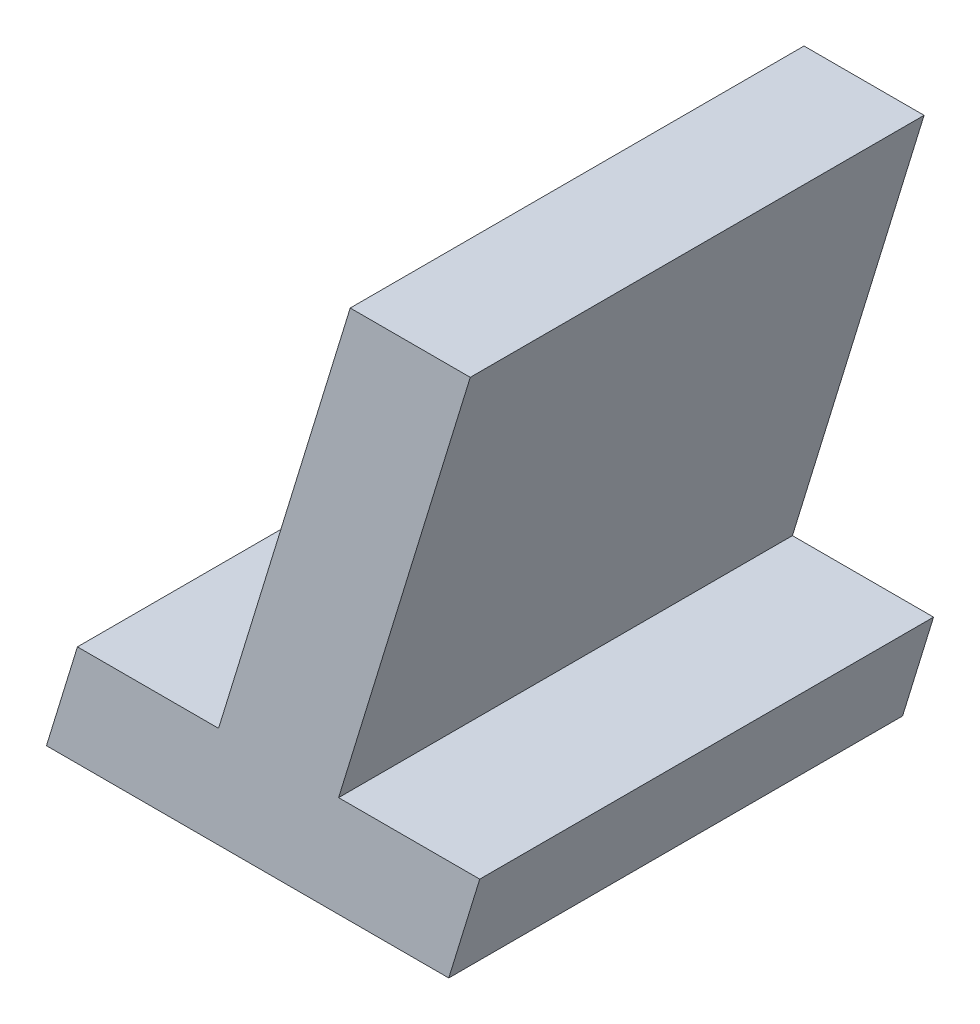
ISO-10303-21;
HEADER;
FILE_DESCRIPTION(('STEP AP214'),'2;1');
FILE_NAME('part.step','',(''),(''),'','','');
FILE_SCHEMA(('AUTOMOTIVE_DESIGN { 1 0 10303 214 1 1 1 1 }'));
ENDSEC;
DATA;
#1=APPLICATION_CONTEXT('core data for automotive mechanical design processes');
#2=APPLICATION_PROTOCOL_DEFINITION('international standard','automotive_design',2000,#1);
#3=PRODUCT_CONTEXT('',#1,'mechanical');
#4=PRODUCT('Part','Part','',(#3));
#5=PRODUCT_RELATED_PRODUCT_CATEGORY('part','',(#4));
#6=PRODUCT_DEFINITION_FORMATION('','',#4);
#7=PRODUCT_DEFINITION_CONTEXT('part definition',#1,'design');
#8=PRODUCT_DEFINITION('design','',#6,#7);
#9=PRODUCT_DEFINITION_SHAPE('','',#8);
#10=(LENGTH_UNIT() NAMED_UNIT(*) SI_UNIT(.MILLI.,.METRE.));
#11=(NAMED_UNIT(*) PLANE_ANGLE_UNIT() SI_UNIT($,.RADIAN.));
#12=(NAMED_UNIT(*) SI_UNIT($,.STERADIAN.) SOLID_ANGLE_UNIT());
#13=UNCERTAINTY_MEASURE_WITH_UNIT(LENGTH_MEASURE(1.E-05),#10,'distance_accuracy_value','');
#14=(GEOMETRIC_REPRESENTATION_CONTEXT(3) GLOBAL_UNCERTAINTY_ASSIGNED_CONTEXT((#13)) GLOBAL_UNIT_ASSIGNED_CONTEXT((#10,
#11,#12)) REPRESENTATION_CONTEXT('',''));
#15=CARTESIAN_POINT('',(0.,0.,0.));
#16=DIRECTION('',(0.,0.,1.));
#17=DIRECTION('',(1.,0.,0.));
#18=AXIS2_PLACEMENT_3D('',#15,#16,#17);
#19=CARTESIAN_POINT('',(5.134104397564,3.535074669142,0.));
#20=DIRECTION('',(-0.956150738053356,0.292875000845109,0.));
#21=DIRECTION('',(-0.292875000845109,-0.956150738053356,0.));
#22=AXIS2_PLACEMENT_3D('',#19,#20,#21);
#23=PLANE('',#22);
#24=DIRECTION('',(-0.292875000836855,-0.956150738055884,0.));
#25=VECTOR('',#24,1.);
#26=CARTESIAN_POINT('',(5.134104397564,3.535074669142,0.1));
#27=LINE('',#26,#25);
#28=CARTESIAN_POINT('',(5.134104397564,3.535074669142,0.1));
#29=VERTEX_POINT('',#28);
#30=CARTESIAN_POINT('',(5.10509143007759,3.44035586352313,0.1));
#31=VERTEX_POINT('',#30);
#32=EDGE_CURVE('E122',#29,#31,#27,.T.);
#33=ORIENTED_EDGE('',*,*,#32,.F.);
#34=DIRECTION('',(0.,0.,1.));
#35=VECTOR('',#34,1.);
#36=CARTESIAN_POINT('',(5.134104397564,3.535074669142,0.));
#37=LINE('',#36,#35);
#38=CARTESIAN_POINT('',(5.134104397564,3.535074669142,0.));
#39=VERTEX_POINT('',#38);
#40=EDGE_CURVE('E87',#39,#29,#37,.T.);
#41=ORIENTED_EDGE('',*,*,#40,.F.);
#42=DIRECTION('',(-0.292875000836855,-0.956150738055884,0.));
#43=VECTOR('',#42,1.);
#44=CARTESIAN_POINT('',(5.134104397564,3.535074669142,0.));
#45=LINE('',#44,#43);
#46=CARTESIAN_POINT('',(5.10509143007759,3.44035586352313,0.));
#47=VERTEX_POINT('',#46);
#48=EDGE_CURVE('E84',#39,#47,#45,.T.);
#49=ORIENTED_EDGE('',*,*,#48,.T.);
#50=DIRECTION('',(0.,0.,1.));
#51=VECTOR('',#50,1.);
#52=CARTESIAN_POINT('',(5.105091430078,3.440355863523,0.));
#53=LINE('',#52,#51);
#54=EDGE_CURVE('E20',#31,#47,#53,.F.);
#55=ORIENTED_EDGE('',*,*,#54,.F.);
#56=EDGE_LOOP('',(#33,#41,#49,#55));
#57=FACE_BOUND('',#56,.T.);
#58=ADVANCED_FACE('F17',(#57),#23,.T.);
#59=CARTESIAN_POINT('',(5.105091430078,3.440355863523,0.));
#60=DIRECTION('',(0.,1.,0.));
#61=DIRECTION('',(0.,0.,1.));
#62=AXIS2_PLACEMENT_3D('',#59,#60,#61);
#63=PLANE('',#62);
#64=DIRECTION('',(1.,0.,0.));
#65=VECTOR('',#64,1.);
#66=CARTESIAN_POINT('',(5.125135669025,3.440355863523,0.1));
#67=LINE('',#66,#65);
#68=CARTESIAN_POINT('',(5.073992562968,3.440355863523,0.1));
#69=VERTEX_POINT('',#68);
#70=EDGE_CURVE('E94',#31,#69,#67,.F.);
#71=ORIENTED_EDGE('',*,*,#70,.F.);
#72=ORIENTED_EDGE('',*,*,#54,.T.);
#73=DIRECTION('',(1.,0.,0.));
#74=VECTOR('',#73,1.);
#75=CARTESIAN_POINT('',(5.125135669025,3.440355863523,0.));
#76=LINE('',#75,#74);
#77=CARTESIAN_POINT('',(5.073992562968,3.440355863523,0.));
#78=VERTEX_POINT('',#77);
#79=EDGE_CURVE('E79',#47,#78,#76,.F.);
#80=ORIENTED_EDGE('',*,*,#79,.T.);
#81=DIRECTION('',(0.,0.,1.));
#82=VECTOR('',#81,1.);
#83=CARTESIAN_POINT('',(5.073992562968,3.440355863523,0.));
#84=LINE('',#83,#82);
#85=EDGE_CURVE('E96',#69,#78,#84,.F.);
#86=ORIENTED_EDGE('',*,*,#85,.F.);
#87=EDGE_LOOP('',(#71,#72,#80,#86));
#88=FACE_BOUND('',#87,.T.);
#89=ADVANCED_FACE('F92',(#88),#63,.T.);
#90=CARTESIAN_POINT('',(5.073992562968,3.440355863523,0.));
#91=DIRECTION('',(-0.956130206843123,0.292942020820038,0.));
#92=DIRECTION('',(-0.292942020820038,-0.956130206843123,0.));
#93=AXIS2_PLACEMENT_3D('',#90,#91,#92);
#94=PLANE('',#93);
#95=DIRECTION('',(-0.292942020813839,-0.956130206845022,0.));
#96=VECTOR('',#95,1.);
#97=CARTESIAN_POINT('',(5.073992562968,3.440355863523,0.1));
#98=LINE('',#97,#96);
#99=CARTESIAN_POINT('',(5.06716598238293,3.41807466300202,0.1));
#100=VERTEX_POINT('',#99);
#101=EDGE_CURVE('E115',#69,#100,#98,.T.);
#102=ORIENTED_EDGE('',*,*,#101,.F.);
#103=ORIENTED_EDGE('',*,*,#85,.T.);
#104=DIRECTION('',(-0.292942020813839,-0.956130206845022,0.));
#105=VECTOR('',#104,1.);
#106=CARTESIAN_POINT('',(5.073992562968,3.440355863523,0.));
#107=LINE('',#106,#105);
#108=CARTESIAN_POINT('',(5.06716598238293,3.41807466300202,0.));
#109=VERTEX_POINT('',#108);
#110=EDGE_CURVE('E101',#78,#109,#107,.T.);
#111=ORIENTED_EDGE('',*,*,#110,.T.);
#112=DIRECTION('',(0.,0.,-1.));
#113=VECTOR('',#112,1.);
#114=CARTESIAN_POINT('',(5.067165982383,3.418074663002,0.));
#115=LINE('',#114,#113);
#116=EDGE_CURVE('E109',#100,#109,#115,.T.);
#117=ORIENTED_EDGE('',*,*,#116,.F.);
#118=EDGE_LOOP('',(#102,#103,#111,#117));
#119=FACE_BOUND('',#118,.T.);
#120=ADVANCED_FACE('F113',(#119),#94,.T.);
#121=CARTESIAN_POINT('',(5.067165982383,3.418074663002,0.));
#122=DIRECTION('',(0.,-1.,0.));
#123=DIRECTION('',(0.,0.,-1.));
#124=AXIS2_PLACEMENT_3D('',#121,#122,#123);
#125=PLANE('',#124);
#126=DIRECTION('',(1.,0.,0.));
#127=VECTOR('',#126,1.);
#128=CARTESIAN_POINT('',(5.125135669025,3.418074663002,0.1));
#129=LINE('',#128,#127);
#130=CARTESIAN_POINT('',(5.15581671637,3.418074663002,0.1));
#131=VERTEX_POINT('',#130);
#132=EDGE_CURVE('E118',#100,#131,#129,.T.);
#133=ORIENTED_EDGE('',*,*,#132,.F.);
#134=ORIENTED_EDGE('',*,*,#116,.T.);
#135=DIRECTION('',(1.,0.,0.));
#136=VECTOR('',#135,1.);
#137=CARTESIAN_POINT('',(5.125135669025,3.418074663002,0.));
#138=LINE('',#137,#136);
#139=CARTESIAN_POINT('',(5.15581671637,3.418074663002,0.));
#140=VERTEX_POINT('',#139);
#141=EDGE_CURVE('E103',#109,#140,#138,.T.);
#142=ORIENTED_EDGE('',*,*,#141,.T.);
#143=DIRECTION('',(0.,0.,1.));
#144=VECTOR('',#143,1.);
#145=CARTESIAN_POINT('',(5.15581671637,3.418074663002,0.));
#146=LINE('',#145,#144);
#147=EDGE_CURVE('E90',#131,#140,#146,.F.);
#148=ORIENTED_EDGE('',*,*,#147,.F.);
#149=EDGE_LOOP('',(#133,#134,#142,#148));
#150=FACE_BOUND('',#149,.T.);
#151=ADVANCED_FACE('F134',(#150),#125,.T.);
#152=CARTESIAN_POINT('',(5.15581671637,3.418074663002,0.));
#153=DIRECTION('',(0.956130206843123,-0.292942020820038,0.));
#154=DIRECTION('',(0.292942020820038,0.956130206843123,0.));
#155=AXIS2_PLACEMENT_3D('',#152,#153,#154);
#156=PLANE('',#155);
#157=DIRECTION('',(0.292942020813839,0.956130206845022,0.));
#158=VECTOR('',#157,1.);
#159=CARTESIAN_POINT('',(5.15581671637,3.418074663002,0.1));
#160=LINE('',#159,#158);
#161=CARTESIAN_POINT('',(5.16264329695504,3.44035586352299,0.1));
#162=VERTEX_POINT('',#161);
#163=EDGE_CURVE('E140',#131,#162,#160,.T.);
#164=ORIENTED_EDGE('',*,*,#163,.F.);
#165=ORIENTED_EDGE('',*,*,#147,.T.);
#166=DIRECTION('',(0.292942020813839,0.956130206845022,0.));
#167=VECTOR('',#166,1.);
#168=CARTESIAN_POINT('',(5.15581671637,3.418074663002,0.));
#169=LINE('',#168,#167);
#170=CARTESIAN_POINT('',(5.16264329695504,3.44035586352299,0.));
#171=VERTEX_POINT('',#170);
#172=EDGE_CURVE('E132',#140,#171,#169,.T.);
#173=ORIENTED_EDGE('',*,*,#172,.T.);
#174=DIRECTION('',(0.,0.,1.));
#175=VECTOR('',#174,1.);
#176=CARTESIAN_POINT('',(5.162643296955,3.440355863523,0.));
#177=LINE('',#176,#175);
#178=EDGE_CURVE('E148',#162,#171,#177,.F.);
#179=ORIENTED_EDGE('',*,*,#178,.F.);
#180=EDGE_LOOP('',(#164,#165,#173,#179));
#181=FACE_BOUND('',#180,.T.);
#182=ADVANCED_FACE('F138',(#181),#156,.T.);
#183=CARTESIAN_POINT('',(5.125135669025,3.462615255849,0.));
#184=DIRECTION('',(0.,0.,1.));
#185=DIRECTION('',(1.,0.,0.));
#186=AXIS2_PLACEMENT_3D('',#183,#184,#185);
#187=PLANE('',#186);
#188=DIRECTION('',(1.,0.,0.));
#189=VECTOR('',#188,1.);
#190=CARTESIAN_POINT('',(5.162643296955,3.440355863523,0.));
#191=LINE('',#190,#189);
#192=CARTESIAN_POINT('',(5.131544429845,3.440355863523,0.));
#193=VERTEX_POINT('',#192);
#194=EDGE_CURVE('E142',#171,#193,#191,.F.);
#195=ORIENTED_EDGE('',*,*,#194,.F.);
#196=ORIENTED_EDGE('',*,*,#172,.F.);
#197=ORIENTED_EDGE('',*,*,#141,.F.);
#198=ORIENTED_EDGE('',*,*,#110,.F.);
#199=ORIENTED_EDGE('',*,*,#79,.F.);
#200=ORIENTED_EDGE('',*,*,#48,.F.);
#201=DIRECTION('',(1.,0.,0.));
#202=VECTOR('',#201,1.);
#203=CARTESIAN_POINT('',(5.160557397332,3.535074669142,0.));
#204=LINE('',#203,#202);
#205=CARTESIAN_POINT('',(5.16055739733198,3.53507466914201,0.));
#206=VERTEX_POINT('',#205);
#207=EDGE_CURVE('E130',#206,#39,#204,.F.);
#208=ORIENTED_EDGE('',*,*,#207,.F.);
#209=DIRECTION('',(0.292875000845109,0.956150738053356,0.));
#210=VECTOR('',#209,1.);
#211=CARTESIAN_POINT('',(5.131544429845,3.440355863523,0.));
#212=LINE('',#211,#210);
#213=EDGE_CURVE('E145',#193,#206,#212,.T.);
#214=ORIENTED_EDGE('',*,*,#213,.F.);
#215=EDGE_LOOP('',(#195,#196,#197,#198,#199,#200,#208,#214));
#216=FACE_BOUND('',#215,.T.);
#217=ADVANCED_FACE('F99',(#216),#187,.F.);
#218=CARTESIAN_POINT('',(5.160557397332,3.535074669142,0.));
#219=DIRECTION('',(0.,1.,0.));
#220=DIRECTION('',(0.,0.,1.));
#221=AXIS2_PLACEMENT_3D('',#218,#219,#220);
#222=PLANE('',#221);
#223=DIRECTION('',(1.,0.,0.));
#224=VECTOR('',#223,1.);
#225=CARTESIAN_POINT('',(5.125135669025,3.535074669142,0.1));
#226=LINE('',#225,#224);
#227=CARTESIAN_POINT('',(5.16055739733198,3.53507466914201,0.1));
#228=VERTEX_POINT('',#227);
#229=EDGE_CURVE('E124',#228,#29,#226,.F.);
#230=ORIENTED_EDGE('',*,*,#229,.F.);
#231=DIRECTION('',(0.,0.,1.));
#232=VECTOR('',#231,1.);
#233=CARTESIAN_POINT('',(5.1605573973319,3.53507466914203,0.));
#234=LINE('',#233,#232);
#235=EDGE_CURVE('E151',#206,#228,#234,.T.);
#236=ORIENTED_EDGE('',*,*,#235,.F.);
#237=ORIENTED_EDGE('',*,*,#207,.T.);
#238=ORIENTED_EDGE('',*,*,#40,.T.);
#239=EDGE_LOOP('',(#230,#236,#237,#238));
#240=FACE_BOUND('',#239,.T.);
#241=ADVANCED_FACE('F163',(#240),#222,.T.);
#242=CARTESIAN_POINT('',(5.125135669025,3.462615255849,0.1));
#243=DIRECTION('',(0.,0.,1.));
#244=DIRECTION('',(1.,0.,0.));
#245=AXIS2_PLACEMENT_3D('',#242,#243,#244);
#246=PLANE('',#245);
#247=ORIENTED_EDGE('',*,*,#163,.T.);
#248=DIRECTION('',(1.,0.,0.));
#249=VECTOR('',#248,1.);
#250=CARTESIAN_POINT('',(5.162643296955,3.440355863523,0.1));
#251=LINE('',#250,#249);
#252=CARTESIAN_POINT('',(5.131544429845,3.440355863523,0.1));
#253=VERTEX_POINT('',#252);
#254=EDGE_CURVE('E35',#253,#162,#251,.T.);
#255=ORIENTED_EDGE('',*,*,#254,.F.);
#256=DIRECTION('',(0.292875000845109,0.956150738053356,0.));
#257=VECTOR('',#256,1.);
#258=CARTESIAN_POINT('',(5.131544429845,3.440355863523,0.1));
#259=LINE('',#258,#257);
#260=EDGE_CURVE('E26',#228,#253,#259,.F.);
#261=ORIENTED_EDGE('',*,*,#260,.F.);
#262=ORIENTED_EDGE('',*,*,#229,.T.);
#263=ORIENTED_EDGE('',*,*,#32,.T.);
#264=ORIENTED_EDGE('',*,*,#70,.T.);
#265=ORIENTED_EDGE('',*,*,#101,.T.);
#266=ORIENTED_EDGE('',*,*,#132,.T.);
#267=EDGE_LOOP('',(#247,#255,#261,#262,#263,#264,#265,#266));
#268=FACE_BOUND('',#267,.T.);
#269=ADVANCED_FACE('F120',(#268),#246,.T.);
#270=CARTESIAN_POINT('',(5.162643296955,3.440355863523,0.));
#271=DIRECTION('',(0.,1.,0.));
#272=DIRECTION('',(0.,0.,1.));
#273=AXIS2_PLACEMENT_3D('',#270,#271,#272);
#274=PLANE('',#273);
#275=ORIENTED_EDGE('',*,*,#254,.T.);
#276=ORIENTED_EDGE('',*,*,#178,.T.);
#277=ORIENTED_EDGE('',*,*,#194,.T.);
#278=DIRECTION('',(0.,0.,1.));
#279=VECTOR('',#278,1.);
#280=CARTESIAN_POINT('',(5.131544429845,3.440355863523,0.));
#281=LINE('',#280,#279);
#282=EDGE_CURVE('E11',#253,#193,#281,.F.);
#283=ORIENTED_EDGE('',*,*,#282,.F.);
#284=EDGE_LOOP('',(#275,#276,#277,#283));
#285=FACE_BOUND('',#284,.T.);
#286=ADVANCED_FACE('F149',(#285),#274,.T.);
#287=CARTESIAN_POINT('',(5.131544429845,3.440355863523,0.));
#288=DIRECTION('',(0.956150738053356,-0.292875000845109,0.));
#289=DIRECTION('',(0.292875000845109,0.956150738053356,0.));
#290=AXIS2_PLACEMENT_3D('',#287,#288,#289);
#291=PLANE('',#290);
#292=ORIENTED_EDGE('',*,*,#260,.T.);
#293=ORIENTED_EDGE('',*,*,#282,.T.);
#294=ORIENTED_EDGE('',*,*,#213,.T.);
#295=ORIENTED_EDGE('',*,*,#235,.T.);
#296=EDGE_LOOP('',(#292,#293,#294,#295));
#297=FACE_BOUND('',#296,.T.);
#298=ADVANCED_FACE('F160',(#297),#291,.T.);
#299=CLOSED_SHELL('',(#58,#89,#120,#151,#182,#217,#241,#269,#286,#298));
#300=MANIFOLD_SOLID_BREP('B1',#299);
#301=ADVANCED_BREP_SHAPE_REPRESENTATION('',(#18,#300),#14);
#302=SHAPE_DEFINITION_REPRESENTATION(#9,#301);
ENDSEC;
END-ISO-10303-21;
